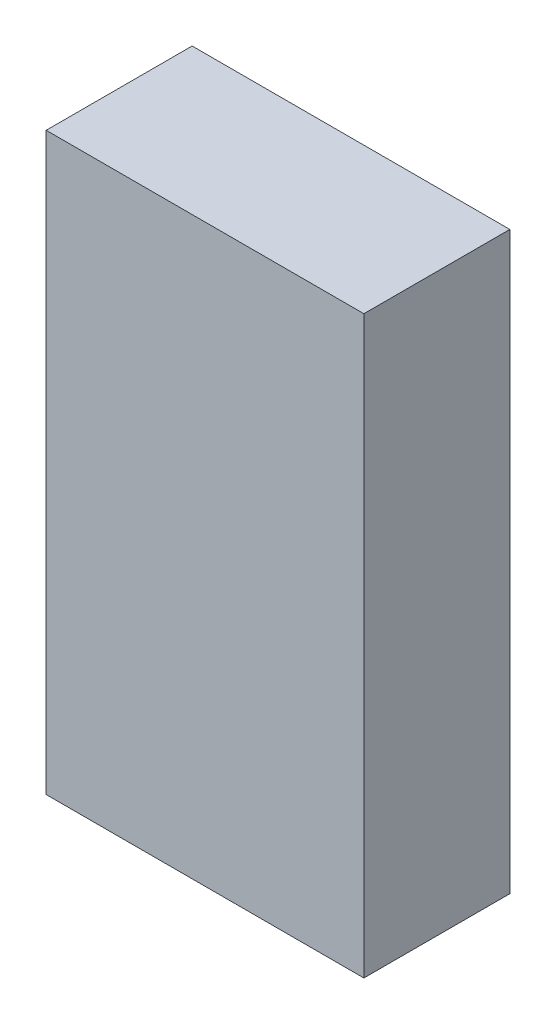
ISO-10303-21;
HEADER;
FILE_DESCRIPTION(('STEP AP214'),'2;1');
FILE_NAME('part.step','',(''),(''),'','','');
FILE_SCHEMA(('AUTOMOTIVE_DESIGN { 1 0 10303 214 1 1 1 1 }'));
ENDSEC;
DATA;
#1=APPLICATION_CONTEXT('core data for automotive mechanical design processes');
#2=APPLICATION_PROTOCOL_DEFINITION('international standard','automotive_design',2000,#1);
#3=PRODUCT_CONTEXT('',#1,'mechanical');
#4=PRODUCT('Part','Part','',(#3));
#5=PRODUCT_RELATED_PRODUCT_CATEGORY('part','',(#4));
#6=PRODUCT_DEFINITION_FORMATION('','',#4);
#7=PRODUCT_DEFINITION_CONTEXT('part definition',#1,'design');
#8=PRODUCT_DEFINITION('design','',#6,#7);
#9=PRODUCT_DEFINITION_SHAPE('','',#8);
#10=(LENGTH_UNIT() NAMED_UNIT(*) SI_UNIT(.MILLI.,.METRE.));
#11=(NAMED_UNIT(*) PLANE_ANGLE_UNIT() SI_UNIT($,.RADIAN.));
#12=(NAMED_UNIT(*) SI_UNIT($,.STERADIAN.) SOLID_ANGLE_UNIT());
#13=UNCERTAINTY_MEASURE_WITH_UNIT(LENGTH_MEASURE(1.E-05),#10,'distance_accuracy_value','');
#14=(GEOMETRIC_REPRESENTATION_CONTEXT(3) GLOBAL_UNCERTAINTY_ASSIGNED_CONTEXT((#13)) GLOBAL_UNIT_ASSIGNED_CONTEXT((#10,
#11,#12)) REPRESENTATION_CONTEXT('',''));
#15=CARTESIAN_POINT('',(0.,0.,0.));
#16=DIRECTION('',(0.,0.,1.));
#17=DIRECTION('',(1.,0.,0.));
#18=AXIS2_PLACEMENT_3D('',#15,#16,#17);
#19=CARTESIAN_POINT('',(-1.84999884,3.35000092,1.69999914));
#20=DIRECTION('',(0.,0.,-1.));
#21=DIRECTION('',(-1.,0.,0.));
#22=AXIS2_PLACEMENT_3D('',#19,#20,#21);
#23=PLANE('',#22);
#24=DIRECTION('',(1.,0.,0.));
#25=VECTOR('',#24,1.);
#26=CARTESIAN_POINT('',(-1.84999884,-3.34999838,1.69999914));
#27=LINE('',#26,#25);
#28=CARTESIAN_POINT('',(-1.84999884,-3.34999838,1.69999914));
#29=VERTEX_POINT('',#28);
#30=CARTESIAN_POINT('',(1.85000138,-3.34999838,1.69999914));
#31=VERTEX_POINT('',#30);
#32=EDGE_CURVE('E55',#29,#31,#27,.T.);
#33=ORIENTED_EDGE('',*,*,#32,.T.);
#34=DIRECTION('',(0.,1.,0.));
#35=VECTOR('',#34,1.);
#36=CARTESIAN_POINT('',(1.85000138,-3.34999838,1.69999914));
#37=LINE('',#36,#35);
#38=CARTESIAN_POINT('',(1.85000138,3.35000092,1.69999914));
#39=VERTEX_POINT('',#38);
#40=EDGE_CURVE('E57',#31,#39,#37,.T.);
#41=ORIENTED_EDGE('',*,*,#40,.T.);
#42=DIRECTION('',(1.,0.,0.));
#43=VECTOR('',#42,1.);
#44=CARTESIAN_POINT('',(1.85000138,3.35000092,1.69999914));
#45=LINE('',#44,#43);
#46=CARTESIAN_POINT('',(-1.84999884,3.35000092,1.69999914));
#47=VERTEX_POINT('',#46);
#48=EDGE_CURVE('E20',#39,#47,#45,.F.);
#49=ORIENTED_EDGE('',*,*,#48,.T.);
#50=DIRECTION('',(0.,1.,0.));
#51=VECTOR('',#50,1.);
#52=CARTESIAN_POINT('',(-1.84999884,3.35000092,1.69999914));
#53=LINE('',#52,#51);
#54=EDGE_CURVE('E80',#47,#29,#53,.F.);
#55=ORIENTED_EDGE('',*,*,#54,.T.);
#56=EDGE_LOOP('',(#33,#41,#49,#55));
#57=FACE_BOUND('',#56,.T.);
#58=ADVANCED_FACE('F17',(#57),#23,.F.);
#59=CARTESIAN_POINT('',(1.85000138,3.35000092,0.));
#60=DIRECTION('',(0.,-1.,0.));
#61=DIRECTION('',(0.,0.,-1.));
#62=AXIS2_PLACEMENT_3D('',#59,#60,#61);
#63=PLANE('',#62);
#64=DIRECTION('',(0.,0.,-1.));
#65=VECTOR('',#64,1.);
#66=CARTESIAN_POINT('',(-1.84999884,3.35000092,0.));
#67=LINE('',#66,#65);
#68=CARTESIAN_POINT('',(-1.84999884,3.35000092,0.));
#69=VERTEX_POINT('',#68);
#70=EDGE_CURVE('E68',#69,#47,#67,.F.);
#71=ORIENTED_EDGE('',*,*,#70,.T.);
#72=ORIENTED_EDGE('',*,*,#48,.F.);
#73=DIRECTION('',(0.,0.,1.));
#74=VECTOR('',#73,1.);
#75=CARTESIAN_POINT('',(1.85000138,3.35000092,0.));
#76=LINE('',#75,#74);
#77=CARTESIAN_POINT('',(1.85000138,3.35000092,0.));
#78=VERTEX_POINT('',#77);
#79=EDGE_CURVE('E63',#39,#78,#76,.F.);
#80=ORIENTED_EDGE('',*,*,#79,.T.);
#81=DIRECTION('',(-1.,0.,0.));
#82=VECTOR('',#81,1.);
#83=CARTESIAN_POINT('',(-1.84999884,3.35000092,0.));
#84=LINE('',#83,#82);
#85=EDGE_CURVE('E83',#69,#78,#84,.F.);
#86=ORIENTED_EDGE('',*,*,#85,.F.);
#87=EDGE_LOOP('',(#71,#72,#80,#86));
#88=FACE_BOUND('',#87,.T.);
#89=ADVANCED_FACE('F65',(#88),#63,.F.);
#90=CARTESIAN_POINT('',(1.85000138,-3.34999838,0.));
#91=DIRECTION('',(-1.,0.,0.));
#92=DIRECTION('',(0.,0.,1.));
#93=AXIS2_PLACEMENT_3D('',#90,#91,#92);
#94=PLANE('',#93);
#95=ORIENTED_EDGE('',*,*,#79,.F.);
#96=ORIENTED_EDGE('',*,*,#40,.F.);
#97=DIRECTION('',(0.,0.,1.));
#98=VECTOR('',#97,1.);
#99=CARTESIAN_POINT('',(1.85000138,-3.34999838,0.));
#100=LINE('',#99,#98);
#101=CARTESIAN_POINT('',(1.85000138,-3.34999838,0.));
#102=VERTEX_POINT('',#101);
#103=EDGE_CURVE('E75',#31,#102,#100,.F.);
#104=ORIENTED_EDGE('',*,*,#103,.T.);
#105=DIRECTION('',(0.,1.,0.));
#106=VECTOR('',#105,1.);
#107=CARTESIAN_POINT('',(1.85000138,3.35000092,0.));
#108=LINE('',#107,#106);
#109=EDGE_CURVE('E72',#78,#102,#108,.F.);
#110=ORIENTED_EDGE('',*,*,#109,.F.);
#111=EDGE_LOOP('',(#95,#96,#104,#110));
#112=FACE_BOUND('',#111,.T.);
#113=ADVANCED_FACE('F70',(#112),#94,.F.);
#114=CARTESIAN_POINT('',(-1.84999884,-3.34999838,0.));
#115=DIRECTION('',(0.,1.,0.));
#116=DIRECTION('',(0.,0.,1.));
#117=AXIS2_PLACEMENT_3D('',#114,#115,#116);
#118=PLANE('',#117);
#119=ORIENTED_EDGE('',*,*,#103,.F.);
#120=ORIENTED_EDGE('',*,*,#32,.F.);
#121=DIRECTION('',(0.,0.,-1.));
#122=VECTOR('',#121,1.);
#123=CARTESIAN_POINT('',(-1.84999884,-3.34999838,0.));
#124=LINE('',#123,#122);
#125=CARTESIAN_POINT('',(-1.84999884,-3.34999838,0.));
#126=VERTEX_POINT('',#125);
#127=EDGE_CURVE('E35',#29,#126,#124,.T.);
#128=ORIENTED_EDGE('',*,*,#127,.T.);
#129=DIRECTION('',(-1.,0.,0.));
#130=VECTOR('',#129,1.);
#131=CARTESIAN_POINT('',(-1.84999884,-3.34999838,0.));
#132=LINE('',#131,#130);
#133=EDGE_CURVE('E26',#102,#126,#132,.T.);
#134=ORIENTED_EDGE('',*,*,#133,.F.);
#135=EDGE_LOOP('',(#119,#120,#128,#134));
#136=FACE_BOUND('',#135,.T.);
#137=ADVANCED_FACE('F89',(#136),#118,.F.);
#138=CARTESIAN_POINT('',(-1.84999884,3.35000092,0.));
#139=DIRECTION('',(1.,0.,0.));
#140=DIRECTION('',(0.,0.,-1.));
#141=AXIS2_PLACEMENT_3D('',#138,#139,#140);
#142=PLANE('',#141);
#143=ORIENTED_EDGE('',*,*,#127,.F.);
#144=ORIENTED_EDGE('',*,*,#54,.F.);
#145=ORIENTED_EDGE('',*,*,#70,.F.);
#146=DIRECTION('',(0.,1.,0.));
#147=VECTOR('',#146,1.);
#148=CARTESIAN_POINT('',(-1.84999884,3.35000092,0.));
#149=LINE('',#148,#147);
#150=EDGE_CURVE('E11',#126,#69,#149,.T.);
#151=ORIENTED_EDGE('',*,*,#150,.F.);
#152=EDGE_LOOP('',(#143,#144,#145,#151));
#153=FACE_BOUND('',#152,.T.);
#154=ADVANCED_FACE('F91',(#153),#142,.F.);
#155=CARTESIAN_POINT('',(-1.84999884,3.35000092,0.));
#156=DIRECTION('',(0.,0.,-1.));
#157=DIRECTION('',(-1.,0.,0.));
#158=AXIS2_PLACEMENT_3D('',#155,#156,#157);
#159=PLANE('',#158);
#160=ORIENTED_EDGE('',*,*,#133,.T.);
#161=ORIENTED_EDGE('',*,*,#150,.T.);
#162=ORIENTED_EDGE('',*,*,#85,.T.);
#163=ORIENTED_EDGE('',*,*,#109,.T.);
#164=EDGE_LOOP('',(#160,#161,#162,#163));
#165=FACE_BOUND('',#164,.T.);
#166=ADVANCED_FACE('F88',(#165),#159,.T.);
#167=CLOSED_SHELL('',(#58,#89,#113,#137,#154,#166));
#168=MANIFOLD_SOLID_BREP('B1',#167);
#169=ADVANCED_BREP_SHAPE_REPRESENTATION('',(#18,#168),#14);
#170=SHAPE_DEFINITION_REPRESENTATION(#9,#169);
ENDSEC;
END-ISO-10303-21;
